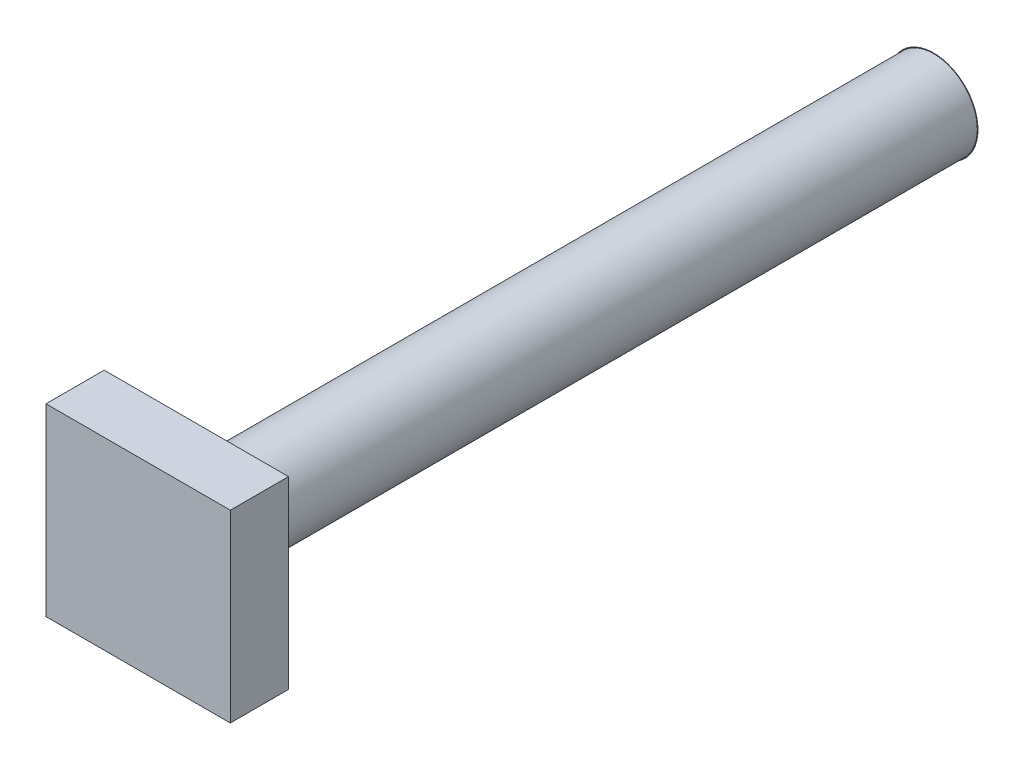
ISO-10303-21;
HEADER;
FILE_DESCRIPTION(('STEP AP214'),'2;1');
FILE_NAME('part.step','',(''),(''),'','','');
FILE_SCHEMA(('AUTOMOTIVE_DESIGN { 1 0 10303 214 1 1 1 1 }'));
ENDSEC;
DATA;
#1=APPLICATION_CONTEXT('core data for automotive mechanical design processes');
#2=APPLICATION_PROTOCOL_DEFINITION('international standard','automotive_design',2000,#1);
#3=PRODUCT_CONTEXT('',#1,'mechanical');
#4=PRODUCT('Part','Part','',(#3));
#5=PRODUCT_RELATED_PRODUCT_CATEGORY('part','',(#4));
#6=PRODUCT_DEFINITION_FORMATION('','',#4);
#7=PRODUCT_DEFINITION_CONTEXT('part definition',#1,'design');
#8=PRODUCT_DEFINITION('design','',#6,#7);
#9=PRODUCT_DEFINITION_SHAPE('','',#8);
#10=(LENGTH_UNIT() NAMED_UNIT(*) SI_UNIT(.MILLI.,.METRE.));
#11=(NAMED_UNIT(*) PLANE_ANGLE_UNIT() SI_UNIT($,.RADIAN.));
#12=(NAMED_UNIT(*) SI_UNIT($,.STERADIAN.) SOLID_ANGLE_UNIT());
#13=UNCERTAINTY_MEASURE_WITH_UNIT(LENGTH_MEASURE(1.E-05),#10,'distance_accuracy_value','');
#14=(GEOMETRIC_REPRESENTATION_CONTEXT(3) GLOBAL_UNCERTAINTY_ASSIGNED_CONTEXT((#13)) GLOBAL_UNIT_ASSIGNED_CONTEXT((#10,
#11,#12)) REPRESENTATION_CONTEXT('',''));
#15=CARTESIAN_POINT('',(0.,0.,0.));
#16=DIRECTION('',(0.,0.,1.));
#17=DIRECTION('',(1.,0.,0.));
#18=AXIS2_PLACEMENT_3D('',#15,#16,#17);
#19=CARTESIAN_POINT('',(0.,0.,0.));
#20=DIRECTION('',(0.,0.,1.));
#21=DIRECTION('',(1.,0.,0.));
#22=AXIS2_PLACEMENT_3D('',#19,#20,#21);
#23=PLANE('',#22);
#24=DIRECTION('',(1.,0.,0.));
#25=VECTOR('',#24,1.);
#26=CARTESIAN_POINT('',(-9.5,-9.5,0.));
#27=LINE('',#26,#25);
#28=CARTESIAN_POINT('',(-9.5,-9.5,0.));
#29=VERTEX_POINT('',#28);
#30=CARTESIAN_POINT('',(9.5,-9.5,0.));
#31=VERTEX_POINT('',#30);
#32=EDGE_CURVE('E102',#29,#31,#27,.T.);
#33=ORIENTED_EDGE('',*,*,#32,.F.);
#34=DIRECTION('',(0.,-1.,0.));
#35=VECTOR('',#34,1.);
#36=CARTESIAN_POINT('',(-9.5,9.5,0.));
#37=LINE('',#36,#35);
#38=CARTESIAN_POINT('',(-9.5,9.5,0.));
#39=VERTEX_POINT('',#38);
#40=EDGE_CURVE('E75',#39,#29,#37,.T.);
#41=ORIENTED_EDGE('',*,*,#40,.F.);
#42=DIRECTION('',(-1.,0.,0.));
#43=VECTOR('',#42,1.);
#44=CARTESIAN_POINT('',(9.5,9.5,0.));
#45=LINE('',#44,#43);
#46=CARTESIAN_POINT('',(9.5,9.5,0.));
#47=VERTEX_POINT('',#46);
#48=EDGE_CURVE('E69',#47,#39,#45,.T.);
#49=ORIENTED_EDGE('',*,*,#48,.F.);
#50=DIRECTION('',(0.,1.,0.));
#51=VECTOR('',#50,1.);
#52=CARTESIAN_POINT('',(9.5,-9.5,0.));
#53=LINE('',#52,#51);
#54=EDGE_CURVE('E93',#31,#47,#53,.T.);
#55=ORIENTED_EDGE('',*,*,#54,.F.);
#56=EDGE_LOOP('',(#33,#41,#49,#55));
#57=FACE_BOUND('',#56,.T.);
#58=CARTESIAN_POINT('',(0.,0.,0.));
#59=DIRECTION('',(0.,0.,1.));
#60=DIRECTION('',(1.,0.,0.));
#61=AXIS2_PLACEMENT_3D('',#58,#59,#60);
#62=CIRCLE('',#61,4.5);
#63=CARTESIAN_POINT('',(4.5,0.,0.));
#64=VERTEX_POINT('',#63);
#65=EDGE_CURVE('E11',#64,#64,#62,.F.);
#66=ORIENTED_EDGE('',*,*,#65,.F.);
#67=EDGE_LOOP('',(#66));
#68=FACE_BOUND('',#67,.T.);
#69=ADVANCED_FACE('F35',(#57,#68),#23,.F.);
#70=CARTESIAN_POINT('',(-9.5,-9.5,6.));
#71=DIRECTION('',(0.,1.,0.));
#72=DIRECTION('',(-1.,0.,0.));
#73=AXIS2_PLACEMENT_3D('',#70,#71,#72);
#74=PLANE('',#73);
#75=ORIENTED_EDGE('',*,*,#32,.T.);
#76=DIRECTION('',(0.,0.,-1.));
#77=VECTOR('',#76,1.);
#78=CARTESIAN_POINT('',(9.5,-9.5,6.));
#79=LINE('',#78,#77);
#80=CARTESIAN_POINT('',(9.5,-9.5,6.));
#81=VERTEX_POINT('',#80);
#82=EDGE_CURVE('E44',#81,#31,#79,.T.);
#83=ORIENTED_EDGE('',*,*,#82,.F.);
#84=DIRECTION('',(1.,0.,0.));
#85=VECTOR('',#84,1.);
#86=CARTESIAN_POINT('',(-9.5,-9.5,6.));
#87=LINE('',#86,#85);
#88=CARTESIAN_POINT('',(-9.5,-9.5,6.));
#89=VERTEX_POINT('',#88);
#90=EDGE_CURVE('E88',#89,#81,#87,.T.);
#91=ORIENTED_EDGE('',*,*,#90,.F.);
#92=DIRECTION('',(0.,0.,-1.));
#93=VECTOR('',#92,1.);
#94=CARTESIAN_POINT('',(-9.5,-9.5,6.));
#95=LINE('',#94,#93);
#96=EDGE_CURVE('E98',#89,#29,#95,.T.);
#97=ORIENTED_EDGE('',*,*,#96,.T.);
#98=EDGE_LOOP('',(#75,#83,#91,#97));
#99=FACE_BOUND('',#98,.T.);
#100=ADVANCED_FACE('F37',(#99),#74,.F.);
#101=CARTESIAN_POINT('',(9.5,-9.5,6.));
#102=DIRECTION('',(-1.,0.,0.));
#103=DIRECTION('',(0.,0.,1.));
#104=AXIS2_PLACEMENT_3D('',#101,#102,#103);
#105=PLANE('',#104);
#106=ORIENTED_EDGE('',*,*,#54,.T.);
#107=DIRECTION('',(0.,0.,-1.));
#108=VECTOR('',#107,1.);
#109=CARTESIAN_POINT('',(9.5,9.5,6.));
#110=LINE('',#109,#108);
#111=CARTESIAN_POINT('',(9.5,9.5,6.));
#112=VERTEX_POINT('',#111);
#113=EDGE_CURVE('E91',#112,#47,#110,.T.);
#114=ORIENTED_EDGE('',*,*,#113,.F.);
#115=DIRECTION('',(0.,1.,0.));
#116=VECTOR('',#115,1.);
#117=CARTESIAN_POINT('',(9.5,-9.5,6.));
#118=LINE('',#117,#116);
#119=EDGE_CURVE('E83',#81,#112,#118,.T.);
#120=ORIENTED_EDGE('',*,*,#119,.F.);
#121=ORIENTED_EDGE('',*,*,#82,.T.);
#122=EDGE_LOOP('',(#106,#114,#120,#121));
#123=FACE_BOUND('',#122,.T.);
#124=ADVANCED_FACE('F92',(#123),#105,.F.);
#125=CARTESIAN_POINT('',(9.5,9.5,6.));
#126=DIRECTION('',(0.,-1.,0.));
#127=DIRECTION('',(1.,0.,0.));
#128=AXIS2_PLACEMENT_3D('',#125,#126,#127);
#129=PLANE('',#128);
#130=ORIENTED_EDGE('',*,*,#48,.T.);
#131=DIRECTION('',(0.,0.,-1.));
#132=VECTOR('',#131,1.);
#133=CARTESIAN_POINT('',(-9.5,9.5,6.));
#134=LINE('',#133,#132);
#135=CARTESIAN_POINT('',(-9.5,9.5,6.));
#136=VERTEX_POINT('',#135);
#137=EDGE_CURVE('E94',#136,#39,#134,.T.);
#138=ORIENTED_EDGE('',*,*,#137,.F.);
#139=DIRECTION('',(-1.,0.,0.));
#140=VECTOR('',#139,1.);
#141=CARTESIAN_POINT('',(9.5,9.5,6.));
#142=LINE('',#141,#140);
#143=EDGE_CURVE('E86',#112,#136,#142,.T.);
#144=ORIENTED_EDGE('',*,*,#143,.F.);
#145=ORIENTED_EDGE('',*,*,#113,.T.);
#146=EDGE_LOOP('',(#130,#138,#144,#145));
#147=FACE_BOUND('',#146,.T.);
#148=ADVANCED_FACE('F96',(#147),#129,.F.);
#149=CARTESIAN_POINT('',(-9.5,9.5,6.));
#150=DIRECTION('',(1.,0.,0.));
#151=DIRECTION('',(0.,1.,0.));
#152=AXIS2_PLACEMENT_3D('',#149,#150,#151);
#153=PLANE('',#152);
#154=ORIENTED_EDGE('',*,*,#40,.T.);
#155=ORIENTED_EDGE('',*,*,#96,.F.);
#156=DIRECTION('',(0.,-1.,0.));
#157=VECTOR('',#156,1.);
#158=CARTESIAN_POINT('',(-9.5,9.5,6.));
#159=LINE('',#158,#157);
#160=EDGE_CURVE('E52',#136,#89,#159,.T.);
#161=ORIENTED_EDGE('',*,*,#160,.F.);
#162=ORIENTED_EDGE('',*,*,#137,.T.);
#163=EDGE_LOOP('',(#154,#155,#161,#162));
#164=FACE_BOUND('',#163,.T.);
#165=ADVANCED_FACE('F130',(#164),#153,.F.);
#166=CARTESIAN_POINT('',(0.,0.,6.));
#167=DIRECTION('',(0.,0.,1.));
#168=DIRECTION('',(1.,0.,0.));
#169=AXIS2_PLACEMENT_3D('',#166,#167,#168);
#170=PLANE('',#169);
#171=ORIENTED_EDGE('',*,*,#90,.T.);
#172=ORIENTED_EDGE('',*,*,#119,.T.);
#173=ORIENTED_EDGE('',*,*,#143,.T.);
#174=ORIENTED_EDGE('',*,*,#160,.T.);
#175=EDGE_LOOP('',(#171,#172,#173,#174));
#176=FACE_BOUND('',#175,.T.);
#177=ADVANCED_FACE('F84',(#176),#170,.T.);
#178=CARTESIAN_POINT('',(0.,0.,-76.));
#179=DIRECTION('',(0.,0.,1.));
#180=DIRECTION('',(1.,0.,0.));
#181=AXIS2_PLACEMENT_3D('',#178,#179,#180);
#182=CYLINDRICAL_SURFACE('',#181,4.5);
#183=CARTESIAN_POINT('',(0.,0.,-76.));
#184=DIRECTION('',(0.,0.,-1.));
#185=DIRECTION('',(-1.,0.,0.));
#186=AXIS2_PLACEMENT_3D('',#183,#184,#185);
#187=CIRCLE('',#186,4.5);
#188=CARTESIAN_POINT('',(-4.5,0.,-76.));
#189=VERTEX_POINT('',#188);
#190=EDGE_CURVE('E105',#189,#189,#187,.T.);
#191=ORIENTED_EDGE('',*,*,#190,.F.);
#192=EDGE_LOOP('',(#191));
#193=FACE_BOUND('',#192,.T.);
#194=ORIENTED_EDGE('',*,*,#65,.T.);
#195=EDGE_LOOP('',(#194));
#196=FACE_BOUND('',#195,.T.);
#197=ADVANCED_FACE('F118',(#193,#196),#182,.T.);
#198=CARTESIAN_POINT('',(0.,0.,-76.));
#199=DIRECTION('',(0.,0.,1.));
#200=DIRECTION('',(1.,0.,0.));
#201=AXIS2_PLACEMENT_3D('',#198,#199,#200);
#202=PLANE('',#201);
#203=CARTESIAN_POINT('',(0.,0.,-76.));
#204=DIRECTION('',(0.,0.,1.));
#205=DIRECTION('',(1.,0.,0.));
#206=AXIS2_PLACEMENT_3D('',#203,#204,#205);
#207=CIRCLE('',#206,4.5692867202606);
#208=CARTESIAN_POINT('',(4.5692867202606,0.,-76.));
#209=VERTEX_POINT('',#208);
#210=EDGE_CURVE('E177',#209,#209,#207,.T.);
#211=ORIENTED_EDGE('',*,*,#210,.T.);
#212=EDGE_LOOP('',(#211));
#213=FACE_BOUND('',#212,.T.);
#214=ORIENTED_EDGE('',*,*,#190,.T.);
#215=EDGE_LOOP('',(#214));
#216=FACE_BOUND('',#215,.T.);
#217=ADVANCED_FACE('F120',(#213,#216),#202,.T.);
#218=CARTESIAN_POINT('',(0.,0.,-54.));
#219=DIRECTION('',(0.,0.,1.));
#220=DIRECTION('',(0.,-1.,0.));
#221=AXIS2_PLACEMENT_3D('',#218,#219,#220);
#222=SPHERICAL_SURFACE('',#221,22.4694989070061);
#223=ORIENTED_EDGE('',*,*,#210,.F.);
#224=EDGE_LOOP('',(#223));
#225=FACE_BOUND('',#224,.T.);
#226=ADVANCED_FACE('F127',(#225),#222,.T.);
#227=CLOSED_SHELL('',(#69,#100,#124,#148,#165,#177,#197,#217,#226));
#228=MANIFOLD_SOLID_BREP('B2',#227);
#229=ADVANCED_BREP_SHAPE_REPRESENTATION('',(#18,#228),#14);
#230=SHAPE_DEFINITION_REPRESENTATION(#9,#229);
ENDSEC;
END-ISO-10303-21;
